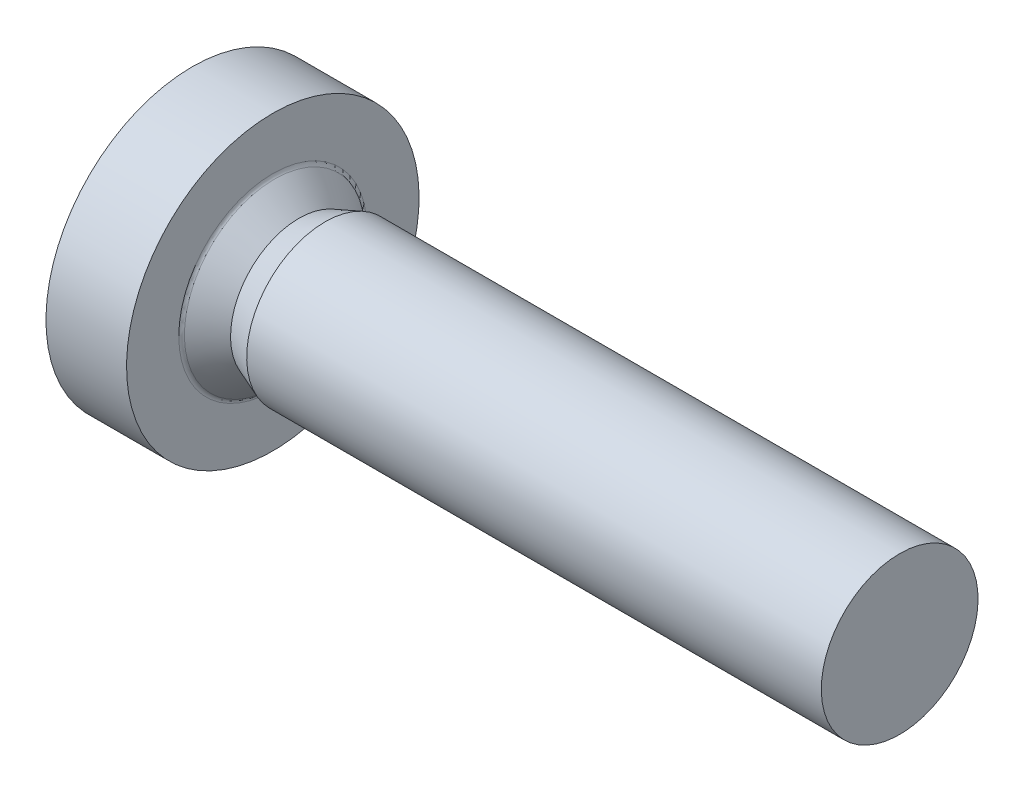
ISO-10303-21;
HEADER;
FILE_DESCRIPTION(('STEP AP214'),'2;1');
FILE_NAME('part.step','',(''),(''),'','','');
FILE_SCHEMA(('AUTOMOTIVE_DESIGN { 1 0 10303 214 1 1 1 1 }'));
ENDSEC;
DATA;
#1=APPLICATION_CONTEXT('core data for automotive mechanical design processes');
#2=APPLICATION_PROTOCOL_DEFINITION('international standard','automotive_design',2000,#1);
#3=PRODUCT_CONTEXT('',#1,'mechanical');
#4=PRODUCT('Part','Part','',(#3));
#5=PRODUCT_RELATED_PRODUCT_CATEGORY('part','',(#4));
#6=PRODUCT_DEFINITION_FORMATION('','',#4);
#7=PRODUCT_DEFINITION_CONTEXT('part definition',#1,'design');
#8=PRODUCT_DEFINITION('design','',#6,#7);
#9=PRODUCT_DEFINITION_SHAPE('','',#8);
#10=(LENGTH_UNIT() NAMED_UNIT(*) SI_UNIT(.MILLI.,.METRE.));
#11=(NAMED_UNIT(*) PLANE_ANGLE_UNIT() SI_UNIT($,.RADIAN.));
#12=(NAMED_UNIT(*) SI_UNIT($,.STERADIAN.) SOLID_ANGLE_UNIT());
#13=UNCERTAINTY_MEASURE_WITH_UNIT(LENGTH_MEASURE(1.E-05),#10,'distance_accuracy_value','');
#14=(GEOMETRIC_REPRESENTATION_CONTEXT(3) GLOBAL_UNCERTAINTY_ASSIGNED_CONTEXT((#13)) GLOBAL_UNIT_ASSIGNED_CONTEXT((#10,
#11,#12)) REPRESENTATION_CONTEXT('',''));
#15=CARTESIAN_POINT('',(0.,0.,0.));
#16=DIRECTION('',(0.,0.,1.));
#17=DIRECTION('',(1.,0.,0.));
#18=AXIS2_PLACEMENT_3D('',#15,#16,#17);
#19=CARTESIAN_POINT('',(12.,0.75,0.));
#20=DIRECTION('',(1.,0.,0.));
#21=DIRECTION('',(0.,1.,0.));
#22=AXIS2_PLACEMENT_3D('',#19,#20,#21);
#23=PLANE('',#22);
#24=CARTESIAN_POINT('',(12.,0.,0.));
#25=DIRECTION('',(1.,0.,0.));
#26=DIRECTION('',(0.,1.,0.));
#27=AXIS2_PLACEMENT_3D('',#24,#25,#26);
#28=CIRCLE('',#27,1.5);
#29=CARTESIAN_POINT('',(12.,1.5,0.));
#30=VERTEX_POINT('',#29);
#31=EDGE_CURVE('E11',#30,#30,#28,.T.);
#32=ORIENTED_EDGE('',*,*,#31,.T.);
#33=EDGE_LOOP('',(#32));
#34=FACE_BOUND('',#33,.T.);
#35=ADVANCED_FACE('F19',(#34),#23,.T.);
#36=CARTESIAN_POINT('',(6.5,0.,0.));
#37=DIRECTION('',(-1.,0.,0.));
#38=DIRECTION('',(0.,1.,0.));
#39=AXIS2_PLACEMENT_3D('',#36,#37,#38);
#40=CYLINDRICAL_SURFACE('',#39,1.5);
#41=CARTESIAN_POINT('',(1.,0.,0.));
#42=DIRECTION('',(1.,0.,0.));
#43=DIRECTION('',(0.,1.,0.));
#44=AXIS2_PLACEMENT_3D('',#41,#42,#43);
#45=CIRCLE('',#44,1.5);
#46=CARTESIAN_POINT('',(1.,1.5,0.));
#47=VERTEX_POINT('',#46);
#48=EDGE_CURVE('E29',#47,#47,#45,.T.);
#49=ORIENTED_EDGE('',*,*,#48,.T.);
#50=EDGE_LOOP('',(#49));
#51=FACE_BOUND('',#50,.T.);
#52=ORIENTED_EDGE('',*,*,#31,.F.);
#53=EDGE_LOOP('',(#52));
#54=FACE_BOUND('',#53,.T.);
#55=ADVANCED_FACE('F422',(#51,#54),#40,.T.);
#56=CARTESIAN_POINT('',(0.75,0.,0.));
#57=DIRECTION('',(1.,0.,0.));
#58=DIRECTION('',(0.,1.,0.));
#59=AXIS2_PLACEMENT_3D('',#56,#57,#58);
#60=CONICAL_SURFACE('',#59,1.404375,0.365329745380517);
#61=CARTESIAN_POINT('',(0.5,0.,0.));
#62=DIRECTION('',(1.,0.,0.));
#63=DIRECTION('',(0.,1.,0.));
#64=AXIS2_PLACEMENT_3D('',#61,#62,#63);
#65=CIRCLE('',#64,1.30875);
#66=CARTESIAN_POINT('',(0.5,1.30875,0.));
#67=VERTEX_POINT('',#66);
#68=EDGE_CURVE('E268',#67,#67,#65,.T.);
#69=ORIENTED_EDGE('',*,*,#68,.T.);
#70=EDGE_LOOP('',(#69));
#71=FACE_BOUND('',#70,.T.);
#72=ORIENTED_EDGE('',*,*,#48,.F.);
#73=EDGE_LOOP('',(#72));
#74=FACE_BOUND('',#73,.T.);
#75=ADVANCED_FACE('F426',(#71,#74),#60,.T.);
#76=CARTESIAN_POINT('',(0.266697090928547,0.,0.));
#77=DIRECTION('',(-1.,0.,0.));
#78=DIRECTION('',(0.,1.,0.));
#79=AXIS2_PLACEMENT_3D('',#76,#77,#78);
#80=CONICAL_SURFACE('',#79,1.51708001042528,0.728911585355214);
#81=CARTESIAN_POINT('',(0.0333941818570946,0.,0.));
#82=DIRECTION('',(1.,0.,0.));
#83=DIRECTION('',(0.,1.,0.));
#84=AXIS2_PLACEMENT_3D('',#81,#82,#83);
#85=CIRCLE('',#84,1.72541002085056);
#86=CARTESIAN_POINT('',(0.0333941818570951,1.72541002085056,0.));
#87=VERTEX_POINT('',#86);
#88=EDGE_CURVE('E296',#87,#87,#85,.T.);
#89=ORIENTED_EDGE('',*,*,#88,.T.);
#90=EDGE_LOOP('',(#89));
#91=FACE_BOUND('',#90,.T.);
#92=ORIENTED_EDGE('',*,*,#68,.F.);
#93=EDGE_LOOP('',(#92));
#94=FACE_BOUND('',#93,.T.);
#95=ADVANCED_FACE('F484',(#91,#94),#80,.T.);
#96=CARTESIAN_POINT('',(0.1,0.,0.));
#97=DIRECTION('',(1.,0.,0.));
#98=DIRECTION('',(0.,0.,-1.));
#99=AXIS2_PLACEMENT_3D('',#96,#97,#98);
#100=TOROIDAL_SURFACE('',#99,1.8,0.1);
#101=CARTESIAN_POINT('',(0.,0.,0.));
#102=DIRECTION('',(1.,0.,0.));
#103=DIRECTION('',(0.,1.,0.));
#104=AXIS2_PLACEMENT_3D('',#101,#102,#103);
#105=CIRCLE('',#104,1.8);
#106=CARTESIAN_POINT('',(0.,1.8,0.));
#107=VERTEX_POINT('',#106);
#108=EDGE_CURVE('E298',#107,#107,#105,.T.);
#109=ORIENTED_EDGE('',*,*,#108,.T.);
#110=EDGE_LOOP('',(#109));
#111=FACE_BOUND('',#110,.T.);
#112=ORIENTED_EDGE('',*,*,#88,.F.);
#113=EDGE_LOOP('',(#112));
#114=FACE_BOUND('',#113,.T.);
#115=ADVANCED_FACE('F452',(#111,#114),#100,.F.);
#116=CARTESIAN_POINT('',(0.,2.3,0.));
#117=DIRECTION('',(1.,0.,0.));
#118=DIRECTION('',(0.,1.,0.));
#119=AXIS2_PLACEMENT_3D('',#116,#117,#118);
#120=PLANE('',#119);
#121=CARTESIAN_POINT('',(0.,0.,0.));
#122=DIRECTION('',(1.,0.,0.));
#123=DIRECTION('',(0.,1.,0.));
#124=AXIS2_PLACEMENT_3D('',#121,#122,#123);
#125=CIRCLE('',#124,2.8);
#126=CARTESIAN_POINT('',(0.,2.8,0.));
#127=VERTEX_POINT('',#126);
#128=EDGE_CURVE('E337',#127,#127,#125,.T.);
#129=ORIENTED_EDGE('',*,*,#128,.T.);
#130=EDGE_LOOP('',(#129));
#131=FACE_BOUND('',#130,.T.);
#132=ORIENTED_EDGE('',*,*,#108,.F.);
#133=EDGE_LOOP('',(#132));
#134=FACE_BOUND('',#133,.T.);
#135=ADVANCED_FACE('F448',(#131,#134),#120,.T.);
#136=CARTESIAN_POINT('',(-0.771231517720798,0.,0.));
#137=DIRECTION('',(-1.,0.,0.));
#138=DIRECTION('',(0.,1.,0.));
#139=AXIS2_PLACEMENT_3D('',#136,#137,#138);
#140=CYLINDRICAL_SURFACE('',#139,2.8);
#141=CARTESIAN_POINT('',(-1.54246303544159,0.,0.));
#142=DIRECTION('',(1.,0.,0.));
#143=DIRECTION('',(0.,1.,0.));
#144=AXIS2_PLACEMENT_3D('',#141,#142,#143);
#145=CIRCLE('',#144,2.8);
#146=CARTESIAN_POINT('',(-1.54246303544159,2.8,0.));
#147=VERTEX_POINT('',#146);
#148=EDGE_CURVE('E271',#147,#147,#145,.T.);
#149=ORIENTED_EDGE('',*,*,#148,.T.);
#150=EDGE_LOOP('',(#149));
#151=FACE_BOUND('',#150,.T.);
#152=ORIENTED_EDGE('',*,*,#128,.F.);
#153=EDGE_LOOP('',(#152));
#154=FACE_BOUND('',#153,.T.);
#155=ADVANCED_FACE('F451',(#151,#154),#140,.T.);
#156=CARTESIAN_POINT('',(2.6,0.,0.));
#157=DIRECTION('',(0.,0.,1.));
#158=DIRECTION('',(1.,0.,0.));
#159=AXIS2_PLACEMENT_3D('',#156,#157,#158);
#160=SPHERICAL_SURFACE('',#159,5.);
#161=ORIENTED_EDGE('',*,*,#148,.F.);
#162=EDGE_LOOP('',(#161));
#163=FACE_BOUND('',#162,.T.);
#164=CARTESIAN_POINT('',(2.6,1.5,0.));
#165=DIRECTION('',(0.,1.,0.));
#166=DIRECTION('',(0.,0.,-1.));
#167=AXIS2_PLACEMENT_3D('',#164,#165,#166);
#168=CIRCLE('',#167,4.76969600708473);
#169=CARTESIAN_POINT('',(-2.16025209416476,1.5,-0.3));
#170=VERTEX_POINT('',#169);
#171=CARTESIAN_POINT('',(-2.16025209416476,1.5,0.3));
#172=VERTEX_POINT('',#171);
#173=EDGE_CURVE('E245',#170,#172,#168,.T.);
#174=ORIENTED_EDGE('',*,*,#173,.T.);
#175=CARTESIAN_POINT('',(2.6,-0.0146530414091956,0.167485029701634));
#176=DIRECTION('',(0.,-0.0871557427476582,0.996194698091746));
#177=DIRECTION('',(0.,0.996194698091746,0.0871557427476581));
#178=AXIS2_PLACEMENT_3D('',#175,#176,#177);
#179=CIRCLE('',#178,4.99717260590459);
#180=CARTESIAN_POINT('',(-2.35893576512593,0.6,0.221260202826669));
#181=VERTEX_POINT('',#180);
#182=EDGE_CURVE('E187',#172,#181,#179,.T.);
#183=ORIENTED_EDGE('',*,*,#182,.T.);
#184=CARTESIAN_POINT('',(2.6,0.245808478247197,0.425752773255334));
#185=DIRECTION('',(0.,0.5,0.866025403784438));
#186=DIRECTION('',(0.,0.866025403784438,-0.5));
#187=AXIS2_PLACEMENT_3D('',#184,#185,#186);
#188=CIRCLE('',#187,4.97577258002083);
#189=CARTESIAN_POINT('',(-2.374028589137,0.359888590016273,0.359888590016274));
#190=VERTEX_POINT('',#189);
#191=EDGE_CURVE('E254',#181,#190,#188,.T.);
#192=ORIENTED_EDGE('',*,*,#191,.T.);
#193=CARTESIAN_POINT('',(2.6,0.425752773255333,0.245808478247197));
#194=DIRECTION('',(0.,0.866025403784439,0.5));
#195=DIRECTION('',(0.,0.5,-0.866025403784439));
#196=AXIS2_PLACEMENT_3D('',#193,#194,#195);
#197=CIRCLE('',#196,4.97577258002083);
#198=CARTESIAN_POINT('',(-2.35893576512593,0.221260202826669,0.6));
#199=VERTEX_POINT('',#198);
#200=EDGE_CURVE('E231',#190,#199,#197,.T.);
#201=ORIENTED_EDGE('',*,*,#200,.T.);
#202=CARTESIAN_POINT('',(2.6,0.167485029701634,-0.0146530414091956));
#203=DIRECTION('',(0.,0.996194698091746,-0.0871557427476583));
#204=DIRECTION('',(0.,-0.0871557427476583,-0.996194698091746));
#205=AXIS2_PLACEMENT_3D('',#202,#203,#204);
#206=CIRCLE('',#205,4.99717260590459);
#207=CARTESIAN_POINT('',(-2.16025209416476,0.3,1.5));
#208=VERTEX_POINT('',#207);
#209=EDGE_CURVE('E266',#199,#208,#206,.T.);
#210=ORIENTED_EDGE('',*,*,#209,.T.);
#211=CARTESIAN_POINT('',(2.6,0.,1.5));
#212=DIRECTION('',(0.,0.,1.));
#213=DIRECTION('',(0.,1.,0.));
#214=AXIS2_PLACEMENT_3D('',#211,#212,#213);
#215=CIRCLE('',#214,4.76969600708473);
#216=CARTESIAN_POINT('',(-2.16025209416476,-0.3,1.5));
#217=VERTEX_POINT('',#216);
#218=EDGE_CURVE('E291',#208,#217,#215,.T.);
#219=ORIENTED_EDGE('',*,*,#218,.T.);
#220=CARTESIAN_POINT('',(2.6,-0.167485029701634,-0.0146530414091956));
#221=DIRECTION('',(0.,-0.996194698091746,-0.0871557427476581));
#222=DIRECTION('',(0.,-0.0871557427476581,0.996194698091746));
#223=AXIS2_PLACEMENT_3D('',#220,#221,#222);
#224=CIRCLE('',#223,4.99717260590459);
#225=CARTESIAN_POINT('',(-2.35893576512593,-0.221260202826669,0.6));
#226=VERTEX_POINT('',#225);
#227=EDGE_CURVE('E275',#217,#226,#224,.T.);
#228=ORIENTED_EDGE('',*,*,#227,.T.);
#229=CARTESIAN_POINT('',(2.6,-0.425752773255333,0.245808478247197));
#230=DIRECTION('',(0.,-0.866025403784439,0.5));
#231=DIRECTION('',(0.,0.5,0.866025403784439));
#232=AXIS2_PLACEMENT_3D('',#229,#230,#231);
#233=CIRCLE('',#232,4.97577258002083);
#234=CARTESIAN_POINT('',(-2.374028589137,-0.359888590016273,0.359888590016274));
#235=VERTEX_POINT('',#234);
#236=EDGE_CURVE('E325',#226,#235,#233,.T.);
#237=ORIENTED_EDGE('',*,*,#236,.T.);
#238=CARTESIAN_POINT('',(2.6,-0.245808478247197,0.425752773255334));
#239=DIRECTION('',(0.,-0.5,0.866025403784439));
#240=DIRECTION('',(0.,0.866025403784439,0.5));
#241=AXIS2_PLACEMENT_3D('',#238,#239,#240);
#242=CIRCLE('',#241,4.97577258002083);
#243=CARTESIAN_POINT('',(-2.35893576512593,-0.6,0.221260202826669));
#244=VERTEX_POINT('',#243);
#245=EDGE_CURVE('E145',#235,#244,#242,.T.);
#246=ORIENTED_EDGE('',*,*,#245,.T.);
#247=CARTESIAN_POINT('',(2.6,0.0146530414091956,0.167485029701634));
#248=DIRECTION('',(0.,0.0871557427476581,0.996194698091746));
#249=DIRECTION('',(0.,0.996194698091746,-0.0871557427476581));
#250=AXIS2_PLACEMENT_3D('',#247,#248,#249);
#251=CIRCLE('',#250,4.99717260590459);
#252=CARTESIAN_POINT('',(-2.16025209416476,-1.5,0.3));
#253=VERTEX_POINT('',#252);
#254=EDGE_CURVE('E278',#244,#253,#251,.T.);
#255=ORIENTED_EDGE('',*,*,#254,.T.);
#256=CARTESIAN_POINT('',(2.6,-1.5,0.));
#257=DIRECTION('',(0.,-1.,0.));
#258=DIRECTION('',(0.,0.,1.));
#259=AXIS2_PLACEMENT_3D('',#256,#257,#258);
#260=CIRCLE('',#259,4.76969600708473);
#261=CARTESIAN_POINT('',(-2.16025209416476,-1.5,-0.3));
#262=VERTEX_POINT('',#261);
#263=EDGE_CURVE('E221',#253,#262,#260,.T.);
#264=ORIENTED_EDGE('',*,*,#263,.T.);
#265=CARTESIAN_POINT('',(2.6,0.0146530414091956,-0.167485029701634));
#266=DIRECTION('',(0.,0.087155742747658,-0.996194698091746));
#267=DIRECTION('',(0.,-0.996194698091746,-0.087155742747658));
#268=AXIS2_PLACEMENT_3D('',#265,#266,#267);
#269=CIRCLE('',#268,4.99717260590459);
#270=CARTESIAN_POINT('',(-2.35893576512593,-0.6,-0.221260202826669));
#271=VERTEX_POINT('',#270);
#272=EDGE_CURVE('E353',#262,#271,#269,.T.);
#273=ORIENTED_EDGE('',*,*,#272,.T.);
#274=CARTESIAN_POINT('',(2.6,-0.245808478247196,-0.425752773255333));
#275=DIRECTION('',(0.,-0.5,-0.866025403784439));
#276=DIRECTION('',(0.,-0.866025403784439,0.5));
#277=AXIS2_PLACEMENT_3D('',#274,#275,#276);
#278=CIRCLE('',#277,4.97577258002083);
#279=CARTESIAN_POINT('',(-2.374028589137,-0.359888590016273,-0.359888590016273));
#280=VERTEX_POINT('',#279);
#281=EDGE_CURVE('E240',#271,#280,#278,.T.);
#282=ORIENTED_EDGE('',*,*,#281,.T.);
#283=CARTESIAN_POINT('',(2.6,-0.425752773255333,-0.245808478247196));
#284=DIRECTION('',(0.,-0.866025403784439,-0.5));
#285=DIRECTION('',(0.,-0.5,0.866025403784439));
#286=AXIS2_PLACEMENT_3D('',#283,#284,#285);
#287=CIRCLE('',#286,4.97577258002083);
#288=CARTESIAN_POINT('',(-2.35893576512593,-0.221260202826669,-0.6));
#289=VERTEX_POINT('',#288);
#290=EDGE_CURVE('E312',#280,#289,#287,.T.);
#291=ORIENTED_EDGE('',*,*,#290,.T.);
#292=CARTESIAN_POINT('',(2.6,-0.167485029701634,0.0146530414091956));
#293=DIRECTION('',(0.,-0.996194698091746,0.0871557427476582));
#294=DIRECTION('',(0.,0.0871557427476582,0.996194698091746));
#295=AXIS2_PLACEMENT_3D('',#292,#293,#294);
#296=CIRCLE('',#295,4.99717260590459);
#297=CARTESIAN_POINT('',(-2.16025209416476,-0.3,-1.5));
#298=VERTEX_POINT('',#297);
#299=EDGE_CURVE('E250',#289,#298,#296,.T.);
#300=ORIENTED_EDGE('',*,*,#299,.T.);
#301=CARTESIAN_POINT('',(2.6,0.,-1.5));
#302=DIRECTION('',(0.,0.,-1.));
#303=DIRECTION('',(0.,-1.,0.));
#304=AXIS2_PLACEMENT_3D('',#301,#302,#303);
#305=CIRCLE('',#304,4.76969600708473);
#306=CARTESIAN_POINT('',(-2.16025209416476,0.3,-1.5));
#307=VERTEX_POINT('',#306);
#308=EDGE_CURVE('E106',#298,#307,#305,.T.);
#309=ORIENTED_EDGE('',*,*,#308,.T.);
#310=CARTESIAN_POINT('',(2.6,0.167485029701634,0.0146530414091956));
#311=DIRECTION('',(0.,0.996194698091746,0.0871557427476582));
#312=DIRECTION('',(0.,0.0871557427476582,-0.996194698091746));
#313=AXIS2_PLACEMENT_3D('',#310,#311,#312);
#314=CIRCLE('',#313,4.99717260590459);
#315=CARTESIAN_POINT('',(-2.35893576512593,0.221260202826669,-0.6));
#316=VERTEX_POINT('',#315);
#317=EDGE_CURVE('E158',#307,#316,#314,.T.);
#318=ORIENTED_EDGE('',*,*,#317,.T.);
#319=CARTESIAN_POINT('',(2.6,0.425752773255333,-0.245808478247196));
#320=DIRECTION('',(0.,0.866025403784439,-0.5));
#321=DIRECTION('',(0.,-0.5,-0.866025403784439));
#322=AXIS2_PLACEMENT_3D('',#319,#320,#321);
#323=CIRCLE('',#322,4.97577258002083);
#324=CARTESIAN_POINT('',(-2.374028589137,0.359888590016273,-0.359888590016274));
#325=VERTEX_POINT('',#324);
#326=EDGE_CURVE('E256',#316,#325,#323,.T.);
#327=ORIENTED_EDGE('',*,*,#326,.T.);
#328=CARTESIAN_POINT('',(2.6,0.245808478247196,-0.425752773255333));
#329=DIRECTION('',(0.,0.5,-0.866025403784439));
#330=DIRECTION('',(0.,-0.866025403784439,-0.5));
#331=AXIS2_PLACEMENT_3D('',#328,#329,#330);
#332=CIRCLE('',#331,4.97577258002083);
#333=CARTESIAN_POINT('',(-2.35893576512593,0.6,-0.221260202826669));
#334=VERTEX_POINT('',#333);
#335=EDGE_CURVE('E244',#325,#334,#332,.T.);
#336=ORIENTED_EDGE('',*,*,#335,.T.);
#337=CARTESIAN_POINT('',(2.6,-0.0146530414091956,-0.167485029701633));
#338=DIRECTION('',(0.,-0.0871557427476582,-0.996194698091746));
#339=DIRECTION('',(0.,-0.996194698091746,0.0871557427476582));
#340=AXIS2_PLACEMENT_3D('',#337,#338,#339);
#341=CIRCLE('',#340,4.99717260590459);
#342=EDGE_CURVE('E236',#334,#170,#341,.T.);
#343=ORIENTED_EDGE('',*,*,#342,.T.);
#344=EDGE_LOOP('',(#174,#183,#192,#201,#210,#219,#228,#237,#246,#255,#264,#273,#282,#291,#300,
#309,#318,#327,#336,#343));
#345=FACE_BOUND('',#344,.T.);
#346=ADVANCED_FACE('F380',(#163,#345),#160,.T.);
#347=CARTESIAN_POINT('',(-1.2,0.,0.));
#348=DIRECTION('',(1.,0.,0.));
#349=DIRECTION('',(0.,0.,-1.));
#350=AXIS2_PLACEMENT_3D('',#347,#348,#349);
#351=PLANE('',#350);
#352=DIRECTION('',(0.,0.,-1.));
#353=VECTOR('',#352,1.);
#354=CARTESIAN_POINT('',(-1.2,1.5,-0.3));
#355=LINE('',#354,#353);
#356=CARTESIAN_POINT('',(-1.2,1.5,0.3));
#357=VERTEX_POINT('',#356);
#358=CARTESIAN_POINT('',(-1.2,1.5,-0.3));
#359=VERTEX_POINT('',#358);
#360=EDGE_CURVE('E247',#357,#359,#355,.T.);
#361=ORIENTED_EDGE('',*,*,#360,.T.);
#362=DIRECTION('',(0.,-0.996194698091746,0.0871557427476582));
#363=VECTOR('',#362,1.);
#364=CARTESIAN_POINT('',(-1.2,1.5,-0.3));
#365=LINE('',#364,#363);
#366=CARTESIAN_POINT('',(-1.2,0.6,-0.221260202826669));
#367=VERTEX_POINT('',#366);
#368=EDGE_CURVE('E233',#359,#367,#365,.T.);
#369=ORIENTED_EDGE('',*,*,#368,.T.);
#370=DIRECTION('',(0.,-0.866025403784439,-0.5));
#371=VECTOR('',#370,1.);
#372=CARTESIAN_POINT('',(-1.2,0.6,-0.221260202826669));
#373=LINE('',#372,#371);
#374=CARTESIAN_POINT('',(-1.2,0.359888590016273,-0.359888590016273));
#375=VERTEX_POINT('',#374);
#376=EDGE_CURVE('E241',#367,#375,#373,.T.);
#377=ORIENTED_EDGE('',*,*,#376,.T.);
#378=DIRECTION('',(0.,-0.5,-0.866025403784439));
#379=VECTOR('',#378,1.);
#380=CARTESIAN_POINT('',(-1.2,0.221260202826669,-0.6));
#381=LINE('',#380,#379);
#382=CARTESIAN_POINT('',(-1.2,0.221260202826669,-0.6));
#383=VERTEX_POINT('',#382);
#384=EDGE_CURVE('E259',#375,#383,#381,.T.);
#385=ORIENTED_EDGE('',*,*,#384,.T.);
#386=DIRECTION('',(0.,0.0871557427476582,-0.996194698091746));
#387=VECTOR('',#386,1.);
#388=CARTESIAN_POINT('',(-1.2,0.3,-1.5));
#389=LINE('',#388,#387);
#390=CARTESIAN_POINT('',(-1.2,0.3,-1.5));
#391=VERTEX_POINT('',#390);
#392=EDGE_CURVE('E163',#383,#391,#389,.T.);
#393=ORIENTED_EDGE('',*,*,#392,.T.);
#394=DIRECTION('',(0.,-1.,0.));
#395=VECTOR('',#394,1.);
#396=CARTESIAN_POINT('',(-1.2,-0.3,-1.5));
#397=LINE('',#396,#395);
#398=CARTESIAN_POINT('',(-1.2,-0.3,-1.5));
#399=VERTEX_POINT('',#398);
#400=EDGE_CURVE('E279',#391,#399,#397,.T.);
#401=ORIENTED_EDGE('',*,*,#400,.T.);
#402=DIRECTION('',(0.,0.0871557427476582,0.996194698091746));
#403=VECTOR('',#402,1.);
#404=CARTESIAN_POINT('',(-1.2,-0.3,-1.5));
#405=LINE('',#404,#403);
#406=CARTESIAN_POINT('',(-1.2,-0.221260202826669,-0.6));
#407=VERTEX_POINT('',#406);
#408=EDGE_CURVE('E113',#399,#407,#405,.T.);
#409=ORIENTED_EDGE('',*,*,#408,.T.);
#410=DIRECTION('',(0.,-0.5,0.866025403784439));
#411=VECTOR('',#410,1.);
#412=CARTESIAN_POINT('',(-1.2,-0.221260202826669,-0.6));
#413=LINE('',#412,#411);
#414=CARTESIAN_POINT('',(-1.2,-0.359888590016273,-0.359888590016273));
#415=VERTEX_POINT('',#414);
#416=EDGE_CURVE('E307',#407,#415,#413,.T.);
#417=ORIENTED_EDGE('',*,*,#416,.T.);
#418=DIRECTION('',(0.,-0.866025403784439,0.5));
#419=VECTOR('',#418,1.);
#420=CARTESIAN_POINT('',(-1.2,-0.6,-0.221260202826669));
#421=LINE('',#420,#419);
#422=CARTESIAN_POINT('',(-1.2,-0.6,-0.221260202826669));
#423=VERTEX_POINT('',#422);
#424=EDGE_CURVE('E330',#415,#423,#421,.T.);
#425=ORIENTED_EDGE('',*,*,#424,.T.);
#426=DIRECTION('',(0.,-0.996194698091746,-0.087155742747658));
#427=VECTOR('',#426,1.);
#428=CARTESIAN_POINT('',(-1.2,-1.5,-0.3));
#429=LINE('',#428,#427);
#430=CARTESIAN_POINT('',(-1.2,-1.5,-0.3));
#431=VERTEX_POINT('',#430);
#432=EDGE_CURVE('E213',#423,#431,#429,.T.);
#433=ORIENTED_EDGE('',*,*,#432,.T.);
#434=DIRECTION('',(0.,0.,1.));
#435=VECTOR('',#434,1.);
#436=CARTESIAN_POINT('',(-1.2,-1.5,0.3));
#437=LINE('',#436,#435);
#438=CARTESIAN_POINT('',(-1.2,-1.5,0.3));
#439=VERTEX_POINT('',#438);
#440=EDGE_CURVE('E210',#431,#439,#437,.T.);
#441=ORIENTED_EDGE('',*,*,#440,.T.);
#442=DIRECTION('',(0.,0.996194698091746,-0.0871557427476581));
#443=VECTOR('',#442,1.);
#444=CARTESIAN_POINT('',(-1.2,-1.5,0.3));
#445=LINE('',#444,#443);
#446=CARTESIAN_POINT('',(-1.2,-0.6,0.221260202826669));
#447=VERTEX_POINT('',#446);
#448=EDGE_CURVE('E199',#439,#447,#445,.T.);
#449=ORIENTED_EDGE('',*,*,#448,.T.);
#450=DIRECTION('',(0.,0.866025403784439,0.5));
#451=VECTOR('',#450,1.);
#452=CARTESIAN_POINT('',(-1.2,-0.6,0.221260202826669));
#453=LINE('',#452,#451);
#454=CARTESIAN_POINT('',(-1.2,-0.359888590016273,0.359888590016274));
#455=VERTEX_POINT('',#454);
#456=EDGE_CURVE('E285',#447,#455,#453,.T.);
#457=ORIENTED_EDGE('',*,*,#456,.T.);
#458=DIRECTION('',(0.,0.5,0.866025403784439));
#459=VECTOR('',#458,1.);
#460=CARTESIAN_POINT('',(-1.2,-0.221260202826669,0.6));
#461=LINE('',#460,#459);
#462=CARTESIAN_POINT('',(-1.2,-0.221260202826669,0.6));
#463=VERTEX_POINT('',#462);
#464=EDGE_CURVE('E272',#455,#463,#461,.T.);
#465=ORIENTED_EDGE('',*,*,#464,.T.);
#466=DIRECTION('',(0.,-0.0871557427476581,0.996194698091746));
#467=VECTOR('',#466,1.);
#468=CARTESIAN_POINT('',(-1.2,-0.3,1.5));
#469=LINE('',#468,#467);
#470=CARTESIAN_POINT('',(-1.2,-0.3,1.5));
#471=VERTEX_POINT('',#470);
#472=EDGE_CURVE('E288',#463,#471,#469,.T.);
#473=ORIENTED_EDGE('',*,*,#472,.T.);
#474=DIRECTION('',(0.,1.,0.));
#475=VECTOR('',#474,1.);
#476=CARTESIAN_POINT('',(-1.2,0.3,1.5));
#477=LINE('',#476,#475);
#478=CARTESIAN_POINT('',(-1.2,0.3,1.5));
#479=VERTEX_POINT('',#478);
#480=EDGE_CURVE('E263',#471,#479,#477,.T.);
#481=ORIENTED_EDGE('',*,*,#480,.T.);
#482=DIRECTION('',(0.,-0.0871557427476583,-0.996194698091746));
#483=VECTOR('',#482,1.);
#484=CARTESIAN_POINT('',(-1.2,0.3,1.5));
#485=LINE('',#484,#483);
#486=CARTESIAN_POINT('',(-1.2,0.221260202826669,0.6));
#487=VERTEX_POINT('',#486);
#488=EDGE_CURVE('E228',#479,#487,#485,.T.);
#489=ORIENTED_EDGE('',*,*,#488,.T.);
#490=DIRECTION('',(0.,0.5,-0.866025403784439));
#491=VECTOR('',#490,1.);
#492=CARTESIAN_POINT('',(-1.2,0.221260202826669,0.6));
#493=LINE('',#492,#491);
#494=CARTESIAN_POINT('',(-1.2,0.359888590016273,0.359888590016274));
#495=VERTEX_POINT('',#494);
#496=EDGE_CURVE('E251',#487,#495,#493,.T.);
#497=ORIENTED_EDGE('',*,*,#496,.T.);
#498=DIRECTION('',(0.,0.866025403784438,-0.5));
#499=VECTOR('',#498,1.);
#500=CARTESIAN_POINT('',(-1.2,0.6,0.221260202826669));
#501=LINE('',#500,#499);
#502=CARTESIAN_POINT('',(-1.2,0.6,0.221260202826669));
#503=VERTEX_POINT('',#502);
#504=EDGE_CURVE('E23',#495,#503,#501,.T.);
#505=ORIENTED_EDGE('',*,*,#504,.T.);
#506=DIRECTION('',(0.,0.996194698091746,0.0871557427476582));
#507=VECTOR('',#506,1.);
#508=CARTESIAN_POINT('',(-1.2,1.5,0.3));
#509=LINE('',#508,#507);
#510=EDGE_CURVE('E139',#503,#357,#509,.T.);
#511=ORIENTED_EDGE('',*,*,#510,.T.);
#512=EDGE_LOOP('',(#361,#369,#377,#385,#393,#401,#409,#417,#425,#433,#441,#449,#457,#465,#473,
#481,#489,#497,#505,#511));
#513=FACE_BOUND('',#512,.T.);
#514=ADVANCED_FACE('F211',(#513),#351,.F.);
#515=CARTESIAN_POINT('',(-2.64,1.05,0.260630101413334));
#516=DIRECTION('',(0.,-0.0871557427476581,0.996194698091746));
#517=DIRECTION('',(0.,-0.996194698091746,-0.0871557427476582));
#518=AXIS2_PLACEMENT_3D('',#515,#516,#517);
#519=PLANE('',#518);
#520=ORIENTED_EDGE('',*,*,#182,.F.);
#521=DIRECTION('',(1.,0.,0.));
#522=VECTOR('',#521,1.);
#523=CARTESIAN_POINT('',(-2.64,1.5,0.3));
#524=LINE('',#523,#522);
#525=EDGE_CURVE('E276',#172,#357,#524,.T.);
#526=ORIENTED_EDGE('',*,*,#525,.T.);
#527=ORIENTED_EDGE('',*,*,#510,.F.);
#528=DIRECTION('',(1.,0.,0.));
#529=VECTOR('',#528,1.);
#530=CARTESIAN_POINT('',(-2.64,0.6,0.221260202826669));
#531=LINE('',#530,#529);
#532=EDGE_CURVE('E262',#181,#503,#531,.T.);
#533=ORIENTED_EDGE('',*,*,#532,.F.);
#534=EDGE_LOOP('',(#520,#526,#527,#533));
#535=FACE_BOUND('',#534,.T.);
#536=ADVANCED_FACE('F389',(#535),#519,.F.);
#537=CARTESIAN_POINT('',(-2.64,0.479944295008137,0.290574396421471));
#538=DIRECTION('',(0.,0.5,0.866025403784438));
#539=DIRECTION('',(0.,-0.866025403784438,0.5));
#540=AXIS2_PLACEMENT_3D('',#537,#538,#539);
#541=PLANE('',#540);
#542=ORIENTED_EDGE('',*,*,#191,.F.);
#543=ORIENTED_EDGE('',*,*,#532,.T.);
#544=ORIENTED_EDGE('',*,*,#504,.F.);
#545=DIRECTION('',(1.,0.,0.));
#546=VECTOR('',#545,1.);
#547=CARTESIAN_POINT('',(-2.64,0.359888590016273,0.359888590016273));
#548=LINE('',#547,#546);
#549=EDGE_CURVE('E255',#190,#495,#548,.T.);
#550=ORIENTED_EDGE('',*,*,#549,.F.);
#551=EDGE_LOOP('',(#542,#543,#544,#550));
#552=FACE_BOUND('',#551,.T.);
#553=ADVANCED_FACE('F388',(#552),#541,.F.);
#554=CARTESIAN_POINT('',(-2.64,0.290574396421471,0.479944295008137));
#555=DIRECTION('',(0.,0.866025403784439,0.5));
#556=DIRECTION('',(0.,-0.5,0.866025403784439));
#557=AXIS2_PLACEMENT_3D('',#554,#555,#556);
#558=PLANE('',#557);
#559=ORIENTED_EDGE('',*,*,#200,.F.);
#560=ORIENTED_EDGE('',*,*,#549,.T.);
#561=ORIENTED_EDGE('',*,*,#496,.F.);
#562=DIRECTION('',(1.,0.,0.));
#563=VECTOR('',#562,1.);
#564=CARTESIAN_POINT('',(-2.64,0.221260202826669,0.6));
#565=LINE('',#564,#563);
#566=EDGE_CURVE('E232',#199,#487,#565,.T.);
#567=ORIENTED_EDGE('',*,*,#566,.F.);
#568=EDGE_LOOP('',(#559,#560,#561,#567));
#569=FACE_BOUND('',#568,.T.);
#570=ADVANCED_FACE('F386',(#569),#558,.F.);
#571=CARTESIAN_POINT('',(-2.64,0.260630101413335,1.05));
#572=DIRECTION('',(0.,0.996194698091746,-0.0871557427476583));
#573=DIRECTION('',(0.,0.0871557427476583,0.996194698091746));
#574=AXIS2_PLACEMENT_3D('',#571,#572,#573);
#575=PLANE('',#574);
#576=ORIENTED_EDGE('',*,*,#209,.F.);
#577=ORIENTED_EDGE('',*,*,#566,.T.);
#578=ORIENTED_EDGE('',*,*,#488,.F.);
#579=DIRECTION('',(1.,0.,0.));
#580=VECTOR('',#579,1.);
#581=CARTESIAN_POINT('',(-2.64,0.3,1.5));
#582=LINE('',#581,#580);
#583=EDGE_CURVE('E267',#208,#479,#582,.T.);
#584=ORIENTED_EDGE('',*,*,#583,.F.);
#585=EDGE_LOOP('',(#576,#577,#578,#584));
#586=FACE_BOUND('',#585,.T.);
#587=ADVANCED_FACE('F371',(#586),#575,.F.);
#588=CARTESIAN_POINT('',(-2.64,0.,1.5));
#589=DIRECTION('',(0.,0.,1.));
#590=DIRECTION('',(0.,-1.,0.));
#591=AXIS2_PLACEMENT_3D('',#588,#589,#590);
#592=PLANE('',#591);
#593=ORIENTED_EDGE('',*,*,#218,.F.);
#594=ORIENTED_EDGE('',*,*,#583,.T.);
#595=ORIENTED_EDGE('',*,*,#480,.F.);
#596=DIRECTION('',(1.,0.,0.));
#597=VECTOR('',#596,1.);
#598=CARTESIAN_POINT('',(-2.64,-0.3,1.5));
#599=LINE('',#598,#597);
#600=EDGE_CURVE('E292',#217,#471,#599,.T.);
#601=ORIENTED_EDGE('',*,*,#600,.F.);
#602=EDGE_LOOP('',(#593,#594,#595,#601));
#603=FACE_BOUND('',#602,.T.);
#604=ADVANCED_FACE('F367',(#603),#592,.F.);
#605=CARTESIAN_POINT('',(-2.64,-0.260630101413334,1.05));
#606=DIRECTION('',(0.,-0.996194698091746,-0.0871557427476581));
#607=DIRECTION('',(0.,0.0871557427476581,-0.996194698091746));
#608=AXIS2_PLACEMENT_3D('',#605,#606,#607);
#609=PLANE('',#608);
#610=ORIENTED_EDGE('',*,*,#227,.F.);
#611=ORIENTED_EDGE('',*,*,#600,.T.);
#612=ORIENTED_EDGE('',*,*,#472,.F.);
#613=DIRECTION('',(1.,0.,0.));
#614=VECTOR('',#613,1.);
#615=CARTESIAN_POINT('',(-2.64,-0.221260202826669,0.6));
#616=LINE('',#615,#614);
#617=EDGE_CURVE('E226',#226,#463,#616,.T.);
#618=ORIENTED_EDGE('',*,*,#617,.F.);
#619=EDGE_LOOP('',(#610,#611,#612,#618));
#620=FACE_BOUND('',#619,.T.);
#621=ADVANCED_FACE('F378',(#620),#609,.F.);
#622=CARTESIAN_POINT('',(-2.64,-0.290574396421471,0.479944295008137));
#623=DIRECTION('',(0.,-0.866025403784439,0.5));
#624=DIRECTION('',(0.,-0.5,-0.866025403784439));
#625=AXIS2_PLACEMENT_3D('',#622,#623,#624);
#626=PLANE('',#625);
#627=ORIENTED_EDGE('',*,*,#236,.F.);
#628=ORIENTED_EDGE('',*,*,#617,.T.);
#629=ORIENTED_EDGE('',*,*,#464,.F.);
#630=DIRECTION('',(1.,0.,0.));
#631=VECTOR('',#630,1.);
#632=CARTESIAN_POINT('',(-2.64,-0.359888590016273,0.359888590016274));
#633=LINE('',#632,#631);
#634=EDGE_CURVE('E282',#235,#455,#633,.T.);
#635=ORIENTED_EDGE('',*,*,#634,.F.);
#636=EDGE_LOOP('',(#627,#628,#629,#635));
#637=FACE_BOUND('',#636,.T.);
#638=ADVANCED_FACE('F467',(#637),#626,.F.);
#639=CARTESIAN_POINT('',(-2.64,-0.479944295008137,0.290574396421471));
#640=DIRECTION('',(0.,-0.5,0.866025403784439));
#641=DIRECTION('',(0.,-0.866025403784439,-0.5));
#642=AXIS2_PLACEMENT_3D('',#639,#640,#641);
#643=PLANE('',#642);
#644=ORIENTED_EDGE('',*,*,#245,.F.);
#645=ORIENTED_EDGE('',*,*,#634,.T.);
#646=ORIENTED_EDGE('',*,*,#456,.F.);
#647=DIRECTION('',(1.,0.,0.));
#648=VECTOR('',#647,1.);
#649=CARTESIAN_POINT('',(-2.64,-0.6,0.221260202826669));
#650=LINE('',#649,#648);
#651=EDGE_CURVE('E206',#244,#447,#650,.T.);
#652=ORIENTED_EDGE('',*,*,#651,.F.);
#653=EDGE_LOOP('',(#644,#645,#646,#652));
#654=FACE_BOUND('',#653,.T.);
#655=ADVANCED_FACE('F21',(#654),#643,.F.);
#656=CARTESIAN_POINT('',(-2.64,-1.05,0.260630101413335));
#657=DIRECTION('',(0.,0.0871557427476581,0.996194698091746));
#658=DIRECTION('',(0.,-0.996194698091746,0.0871557427476581));
#659=AXIS2_PLACEMENT_3D('',#656,#657,#658);
#660=PLANE('',#659);
#661=ORIENTED_EDGE('',*,*,#254,.F.);
#662=ORIENTED_EDGE('',*,*,#651,.T.);
#663=ORIENTED_EDGE('',*,*,#448,.F.);
#664=DIRECTION('',(1.,0.,0.));
#665=VECTOR('',#664,1.);
#666=CARTESIAN_POINT('',(-2.64,-1.5,0.3));
#667=LINE('',#666,#665);
#668=EDGE_CURVE('E204',#253,#439,#667,.T.);
#669=ORIENTED_EDGE('',*,*,#668,.F.);
#670=EDGE_LOOP('',(#661,#662,#663,#669));
#671=FACE_BOUND('',#670,.T.);
#672=ADVANCED_FACE('F202',(#671),#660,.F.);
#673=CARTESIAN_POINT('',(-2.64,1.5,0.));
#674=DIRECTION('',(0.,1.,0.));
#675=DIRECTION('',(0.,0.,1.));
#676=AXIS2_PLACEMENT_3D('',#673,#674,#675);
#677=PLANE('',#676);
#678=ORIENTED_EDGE('',*,*,#173,.F.);
#679=DIRECTION('',(1.,0.,0.));
#680=VECTOR('',#679,1.);
#681=CARTESIAN_POINT('',(-2.64,1.5,-0.3));
#682=LINE('',#681,#680);
#683=EDGE_CURVE('E235',#170,#359,#682,.T.);
#684=ORIENTED_EDGE('',*,*,#683,.T.);
#685=ORIENTED_EDGE('',*,*,#360,.F.);
#686=ORIENTED_EDGE('',*,*,#525,.F.);
#687=EDGE_LOOP('',(#678,#684,#685,#686));
#688=FACE_BOUND('',#687,.T.);
#689=ADVANCED_FACE('F393',(#688),#677,.F.);
#690=CARTESIAN_POINT('',(-2.64,1.05,-0.260630101413335));
#691=DIRECTION('',(0.,-0.0871557427476582,-0.996194698091746));
#692=DIRECTION('',(0.,0.996194698091746,-0.0871557427476582));
#693=AXIS2_PLACEMENT_3D('',#690,#691,#692);
#694=PLANE('',#693);
#695=ORIENTED_EDGE('',*,*,#342,.F.);
#696=DIRECTION('',(1.,0.,0.));
#697=VECTOR('',#696,1.);
#698=CARTESIAN_POINT('',(-2.64,0.6,-0.221260202826669));
#699=LINE('',#698,#697);
#700=EDGE_CURVE('E243',#334,#367,#699,.T.);
#701=ORIENTED_EDGE('',*,*,#700,.T.);
#702=ORIENTED_EDGE('',*,*,#368,.F.);
#703=ORIENTED_EDGE('',*,*,#683,.F.);
#704=EDGE_LOOP('',(#695,#701,#702,#703));
#705=FACE_BOUND('',#704,.T.);
#706=ADVANCED_FACE('F398',(#705),#694,.F.);
#707=CARTESIAN_POINT('',(-2.64,0.479944295008137,-0.290574396421471));
#708=DIRECTION('',(0.,0.5,-0.866025403784439));
#709=DIRECTION('',(0.,0.866025403784439,0.5));
#710=AXIS2_PLACEMENT_3D('',#707,#708,#709);
#711=PLANE('',#710);
#712=ORIENTED_EDGE('',*,*,#335,.F.);
#713=DIRECTION('',(1.,0.,0.));
#714=VECTOR('',#713,1.);
#715=CARTESIAN_POINT('',(-2.64,0.359888590016273,-0.359888590016274));
#716=LINE('',#715,#714);
#717=EDGE_CURVE('E303',#325,#375,#716,.T.);
#718=ORIENTED_EDGE('',*,*,#717,.T.);
#719=ORIENTED_EDGE('',*,*,#376,.F.);
#720=ORIENTED_EDGE('',*,*,#700,.F.);
#721=EDGE_LOOP('',(#712,#718,#719,#720));
#722=FACE_BOUND('',#721,.T.);
#723=ADVANCED_FACE('F400',(#722),#711,.F.);
#724=CARTESIAN_POINT('',(-2.64,0.290574396421471,-0.479944295008137));
#725=DIRECTION('',(0.,0.866025403784439,-0.5));
#726=DIRECTION('',(0.,0.5,0.866025403784439));
#727=AXIS2_PLACEMENT_3D('',#724,#725,#726);
#728=PLANE('',#727);
#729=ORIENTED_EDGE('',*,*,#326,.F.);
#730=DIRECTION('',(1.,0.,0.));
#731=VECTOR('',#730,1.);
#732=CARTESIAN_POINT('',(-2.64,0.221260202826669,-0.6));
#733=LINE('',#732,#731);
#734=EDGE_CURVE('E260',#316,#383,#733,.T.);
#735=ORIENTED_EDGE('',*,*,#734,.T.);
#736=ORIENTED_EDGE('',*,*,#384,.F.);
#737=ORIENTED_EDGE('',*,*,#717,.F.);
#738=EDGE_LOOP('',(#729,#735,#736,#737));
#739=FACE_BOUND('',#738,.T.);
#740=ADVANCED_FACE('F402',(#739),#728,.F.);
#741=CARTESIAN_POINT('',(-2.64,0.260630101413335,-1.05));
#742=DIRECTION('',(0.,0.996194698091746,0.0871557427476582));
#743=DIRECTION('',(0.,-0.0871557427476582,0.996194698091746));
#744=AXIS2_PLACEMENT_3D('',#741,#742,#743);
#745=PLANE('',#744);
#746=ORIENTED_EDGE('',*,*,#317,.F.);
#747=DIRECTION('',(1.,0.,0.));
#748=VECTOR('',#747,1.);
#749=CARTESIAN_POINT('',(-2.64,0.3,-1.5));
#750=LINE('',#749,#748);
#751=EDGE_CURVE('E281',#307,#391,#750,.T.);
#752=ORIENTED_EDGE('',*,*,#751,.T.);
#753=ORIENTED_EDGE('',*,*,#392,.F.);
#754=ORIENTED_EDGE('',*,*,#734,.F.);
#755=EDGE_LOOP('',(#746,#752,#753,#754));
#756=FACE_BOUND('',#755,.T.);
#757=ADVANCED_FACE('F403',(#756),#745,.F.);
#758=CARTESIAN_POINT('',(-2.64,0.,-1.5));
#759=DIRECTION('',(0.,0.,-1.));
#760=DIRECTION('',(0.,1.,0.));
#761=AXIS2_PLACEMENT_3D('',#758,#759,#760);
#762=PLANE('',#761);
#763=ORIENTED_EDGE('',*,*,#308,.F.);
#764=DIRECTION('',(1.,0.,0.));
#765=VECTOR('',#764,1.);
#766=CARTESIAN_POINT('',(-2.64,-0.3,-1.5));
#767=LINE('',#766,#765);
#768=EDGE_CURVE('E249',#298,#399,#767,.T.);
#769=ORIENTED_EDGE('',*,*,#768,.T.);
#770=ORIENTED_EDGE('',*,*,#400,.F.);
#771=ORIENTED_EDGE('',*,*,#751,.F.);
#772=EDGE_LOOP('',(#763,#769,#770,#771));
#773=FACE_BOUND('',#772,.T.);
#774=ADVANCED_FACE('F405',(#773),#762,.F.);
#775=CARTESIAN_POINT('',(-2.64,-0.260630101413334,-1.05));
#776=DIRECTION('',(0.,-0.996194698091746,0.0871557427476582));
#777=DIRECTION('',(0.,-0.0871557427476582,-0.996194698091746));
#778=AXIS2_PLACEMENT_3D('',#775,#776,#777);
#779=PLANE('',#778);
#780=ORIENTED_EDGE('',*,*,#299,.F.);
#781=DIRECTION('',(1.,0.,0.));
#782=VECTOR('',#781,1.);
#783=CARTESIAN_POINT('',(-2.64,-0.221260202826669,-0.6));
#784=LINE('',#783,#782);
#785=EDGE_CURVE('E305',#289,#407,#784,.T.);
#786=ORIENTED_EDGE('',*,*,#785,.T.);
#787=ORIENTED_EDGE('',*,*,#408,.F.);
#788=ORIENTED_EDGE('',*,*,#768,.F.);
#789=EDGE_LOOP('',(#780,#786,#787,#788));
#790=FACE_BOUND('',#789,.T.);
#791=ADVANCED_FACE('F406',(#790),#779,.F.);
#792=CARTESIAN_POINT('',(-2.64,-0.290574396421471,-0.479944295008137));
#793=DIRECTION('',(0.,-0.866025403784439,-0.5));
#794=DIRECTION('',(0.,0.5,-0.866025403784439));
#795=AXIS2_PLACEMENT_3D('',#792,#793,#794);
#796=PLANE('',#795);
#797=ORIENTED_EDGE('',*,*,#290,.F.);
#798=DIRECTION('',(1.,0.,0.));
#799=VECTOR('',#798,1.);
#800=CARTESIAN_POINT('',(-2.64,-0.359888590016273,-0.359888590016273));
#801=LINE('',#800,#799);
#802=EDGE_CURVE('E327',#280,#415,#801,.T.);
#803=ORIENTED_EDGE('',*,*,#802,.T.);
#804=ORIENTED_EDGE('',*,*,#416,.F.);
#805=ORIENTED_EDGE('',*,*,#785,.F.);
#806=EDGE_LOOP('',(#797,#803,#804,#805));
#807=FACE_BOUND('',#806,.T.);
#808=ADVANCED_FACE('F408',(#807),#796,.F.);
#809=CARTESIAN_POINT('',(-2.64,-0.479944295008137,-0.290574396421471));
#810=DIRECTION('',(0.,-0.5,-0.866025403784439));
#811=DIRECTION('',(0.,0.866025403784439,-0.5));
#812=AXIS2_PLACEMENT_3D('',#809,#810,#811);
#813=PLANE('',#812);
#814=ORIENTED_EDGE('',*,*,#281,.F.);
#815=DIRECTION('',(1.,0.,0.));
#816=VECTOR('',#815,1.);
#817=CARTESIAN_POINT('',(-2.64,-0.6,-0.221260202826669));
#818=LINE('',#817,#816);
#819=EDGE_CURVE('E237',#271,#423,#818,.T.);
#820=ORIENTED_EDGE('',*,*,#819,.T.);
#821=ORIENTED_EDGE('',*,*,#424,.F.);
#822=ORIENTED_EDGE('',*,*,#802,.F.);
#823=EDGE_LOOP('',(#814,#820,#821,#822));
#824=FACE_BOUND('',#823,.T.);
#825=ADVANCED_FACE('F415',(#824),#813,.F.);
#826=CARTESIAN_POINT('',(-2.64,-1.05,-0.260630101413334));
#827=DIRECTION('',(0.,0.087155742747658,-0.996194698091746));
#828=DIRECTION('',(0.,0.996194698091746,0.087155742747658));
#829=AXIS2_PLACEMENT_3D('',#826,#827,#828);
#830=PLANE('',#829);
#831=ORIENTED_EDGE('',*,*,#272,.F.);
#832=DIRECTION('',(1.,0.,0.));
#833=VECTOR('',#832,1.);
#834=CARTESIAN_POINT('',(-2.64,-1.5,-0.3));
#835=LINE('',#834,#833);
#836=EDGE_CURVE('E217',#262,#431,#835,.T.);
#837=ORIENTED_EDGE('',*,*,#836,.T.);
#838=ORIENTED_EDGE('',*,*,#432,.F.);
#839=ORIENTED_EDGE('',*,*,#819,.F.);
#840=EDGE_LOOP('',(#831,#837,#838,#839));
#841=FACE_BOUND('',#840,.T.);
#842=ADVANCED_FACE('F430',(#841),#830,.F.);
#843=CARTESIAN_POINT('',(-2.64,-1.5,0.));
#844=DIRECTION('',(0.,-1.,0.));
#845=DIRECTION('',(0.,0.,-1.));
#846=AXIS2_PLACEMENT_3D('',#843,#844,#845);
#847=PLANE('',#846);
#848=ORIENTED_EDGE('',*,*,#263,.F.);
#849=ORIENTED_EDGE('',*,*,#668,.T.);
#850=ORIENTED_EDGE('',*,*,#440,.F.);
#851=ORIENTED_EDGE('',*,*,#836,.F.);
#852=EDGE_LOOP('',(#848,#849,#850,#851));
#853=FACE_BOUND('',#852,.T.);
#854=ADVANCED_FACE('F219',(#853),#847,.F.);
#855=CLOSED_SHELL('',(#35,#55,#75,#95,#115,#135,#155,#346,#514,#536,#553,#570,#587,#604,#621,
#638,#655,#672,#689,#706,#723,#740,#757,#774,#791,#808,#825,#842,#854));
#856=MANIFOLD_SOLID_BREP('B1',#855);
#857=ADVANCED_BREP_SHAPE_REPRESENTATION('',(#18,#856),#14);
#858=SHAPE_DEFINITION_REPRESENTATION(#9,#857);
ENDSEC;
END-ISO-10303-21;
